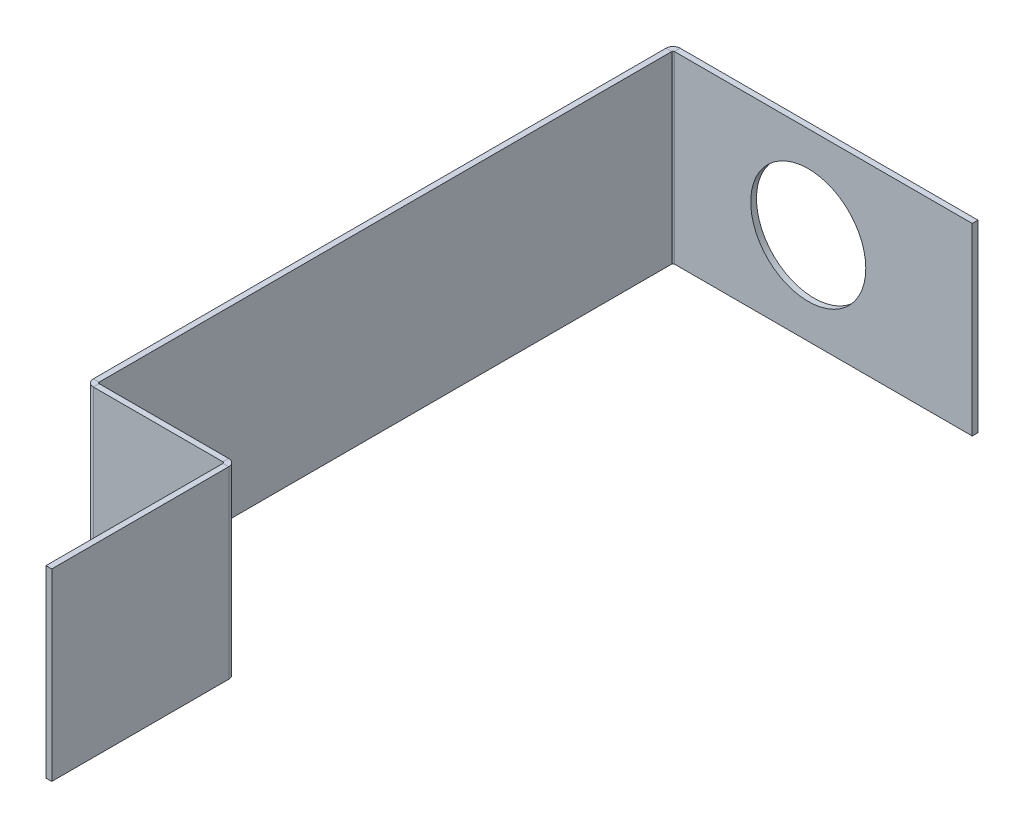
ISO-10303-21;
HEADER;
FILE_DESCRIPTION(('STEP AP214'),'2;1');
FILE_NAME('part.step','',(''),(''),'','','');
FILE_SCHEMA(('AUTOMOTIVE_DESIGN { 1 0 10303 214 1 1 1 1 }'));
ENDSEC;
DATA;
#1=APPLICATION_CONTEXT('core data for automotive mechanical design processes');
#2=APPLICATION_PROTOCOL_DEFINITION('international standard','automotive_design',2000,#1);
#3=PRODUCT_CONTEXT('',#1,'mechanical');
#4=PRODUCT('Part','Part','',(#3));
#5=PRODUCT_RELATED_PRODUCT_CATEGORY('part','',(#4));
#6=PRODUCT_DEFINITION_FORMATION('','',#4);
#7=PRODUCT_DEFINITION_CONTEXT('part definition',#1,'design');
#8=PRODUCT_DEFINITION('design','',#6,#7);
#9=PRODUCT_DEFINITION_SHAPE('','',#8);
#10=(LENGTH_UNIT() NAMED_UNIT(*) SI_UNIT(.MILLI.,.METRE.));
#11=(NAMED_UNIT(*) PLANE_ANGLE_UNIT() SI_UNIT($,.RADIAN.));
#12=(NAMED_UNIT(*) SI_UNIT($,.STERADIAN.) SOLID_ANGLE_UNIT());
#13=UNCERTAINTY_MEASURE_WITH_UNIT(LENGTH_MEASURE(1.E-05),#10,'distance_accuracy_value','');
#14=(GEOMETRIC_REPRESENTATION_CONTEXT(3) GLOBAL_UNCERTAINTY_ASSIGNED_CONTEXT((#13)) GLOBAL_UNIT_ASSIGNED_CONTEXT((#10,
#11,#12)) REPRESENTATION_CONTEXT('',''));
#15=CARTESIAN_POINT('',(0.,0.,0.));
#16=DIRECTION('',(0.,0.,1.));
#17=DIRECTION('',(1.,0.,0.));
#18=AXIS2_PLACEMENT_3D('',#15,#16,#17);
#19=CARTESIAN_POINT('',(0.,101.6,-189.7634));
#20=DIRECTION('',(0.,1.,0.));
#21=DIRECTION('',(0.,0.,1.));
#22=AXIS2_PLACEMENT_3D('',#19,#20,#21);
#23=PLANE('',#22);
#24=DIRECTION('',(-1.,0.,0.));
#25=VECTOR('',#24,1.);
#26=CARTESIAN_POINT('',(0.,101.6,-189.7634));
#27=LINE('',#26,#25);
#28=CARTESIAN_POINT('',(0.,101.6,-189.7634));
#29=VERTEX_POINT('',#28);
#30=CARTESIAN_POINT('',(-3.175,101.6,-189.7634));
#31=VERTEX_POINT('',#30);
#32=EDGE_CURVE('E11',#29,#31,#27,.T.);
#33=ORIENTED_EDGE('',*,*,#32,.F.);
#34=CARTESIAN_POINT('',(0.7366,101.6,-189.7634));
#35=DIRECTION('',(0.,-1.,0.));
#36=DIRECTION('',(0.,0.,-1.));
#37=AXIS2_PLACEMENT_3D('',#34,#35,#36);
#38=CIRCLE('',#37,0.7366);
#39=CARTESIAN_POINT('',(0.7366,101.6,-190.5));
#40=VERTEX_POINT('',#39);
#41=EDGE_CURVE('E310',#40,#29,#38,.F.);
#42=ORIENTED_EDGE('',*,*,#41,.F.);
#43=DIRECTION('',(0.,0.,1.));
#44=VECTOR('',#43,1.);
#45=CARTESIAN_POINT('',(0.7366,101.6,-193.675));
#46=LINE('',#45,#44);
#47=CARTESIAN_POINT('',(0.7366,101.6,-193.675));
#48=VERTEX_POINT('',#47);
#49=EDGE_CURVE('E44',#48,#40,#46,.T.);
#50=ORIENTED_EDGE('',*,*,#49,.F.);
#51=CARTESIAN_POINT('',(0.7366,101.6,-189.7634));
#52=DIRECTION('',(0.,1.,0.));
#53=DIRECTION('',(1.,0.,0.));
#54=AXIS2_PLACEMENT_3D('',#51,#52,#53);
#55=CIRCLE('',#54,3.9116);
#56=EDGE_CURVE('E323',#48,#31,#55,.T.);
#57=ORIENTED_EDGE('',*,*,#56,.T.);
#58=EDGE_LOOP('',(#33,#42,#50,#57));
#59=FACE_BOUND('',#58,.T.);
#60=ADVANCED_FACE('F36',(#59),#23,.T.);
#61=CARTESIAN_POINT('',(0.7366,101.6,-193.675));
#62=DIRECTION('',(0.,1.,0.));
#63=DIRECTION('',(0.,0.,1.));
#64=AXIS2_PLACEMENT_3D('',#61,#62,#63);
#65=PLANE('',#64);
#66=DIRECTION('',(0.,0.,1.));
#67=VECTOR('',#66,1.);
#68=CARTESIAN_POINT('',(0.,101.6,0.));
#69=LINE('',#68,#67);
#70=CARTESIAN_POINT('',(0.,101.6,126.2634));
#71=VERTEX_POINT('',#70);
#72=EDGE_CURVE('E314',#29,#71,#69,.T.);
#73=ORIENTED_EDGE('',*,*,#72,.F.);
#74=ORIENTED_EDGE('',*,*,#32,.T.);
#75=DIRECTION('',(0.,0.,-1.));
#76=VECTOR('',#75,1.);
#77=CARTESIAN_POINT('',(-3.175,101.6,0.));
#78=LINE('',#77,#76);
#79=CARTESIAN_POINT('',(-3.17499999999998,101.6,126.2634));
#80=VERTEX_POINT('',#79);
#81=EDGE_CURVE('E179',#31,#80,#78,.F.);
#82=ORIENTED_EDGE('',*,*,#81,.T.);
#83=DIRECTION('',(1.,0.,0.));
#84=VECTOR('',#83,1.);
#85=CARTESIAN_POINT('',(-3.17499999999998,101.6,126.2634));
#86=LINE('',#85,#84);
#87=EDGE_CURVE('E170',#80,#71,#86,.T.);
#88=ORIENTED_EDGE('',*,*,#87,.T.);
#89=EDGE_LOOP('',(#73,#74,#82,#88));
#90=FACE_BOUND('',#89,.T.);
#91=ADVANCED_FACE('F327',(#90),#65,.T.);
#92=CARTESIAN_POINT('',(0.7366,0.,-190.5));
#93=DIRECTION('',(0.,-1.,0.));
#94=DIRECTION('',(0.,0.,-1.));
#95=AXIS2_PLACEMENT_3D('',#92,#93,#94);
#96=PLANE('',#95);
#97=DIRECTION('',(0.,0.,-1.));
#98=VECTOR('',#97,1.);
#99=CARTESIAN_POINT('',(0.7366,0.,-190.5));
#100=LINE('',#99,#98);
#101=CARTESIAN_POINT('',(0.7366,0.,-190.5));
#102=VERTEX_POINT('',#101);
#103=CARTESIAN_POINT('',(0.7366,0.,-193.675));
#104=VERTEX_POINT('',#103);
#105=EDGE_CURVE('E290',#102,#104,#100,.T.);
#106=ORIENTED_EDGE('',*,*,#105,.F.);
#107=CARTESIAN_POINT('',(0.7366,0.,-189.7634));
#108=DIRECTION('',(0.,-1.,0.));
#109=DIRECTION('',(0.,0.,-1.));
#110=AXIS2_PLACEMENT_3D('',#107,#108,#109);
#111=CIRCLE('',#110,0.7366);
#112=CARTESIAN_POINT('',(0.,0.,-189.7634));
#113=VERTEX_POINT('',#112);
#114=EDGE_CURVE('E220',#102,#113,#111,.F.);
#115=ORIENTED_EDGE('',*,*,#114,.T.);
#116=DIRECTION('',(1.,0.,0.));
#117=VECTOR('',#116,1.);
#118=CARTESIAN_POINT('',(-3.175,0.,-189.7634));
#119=LINE('',#118,#117);
#120=CARTESIAN_POINT('',(-3.175,0.,-189.7634));
#121=VERTEX_POINT('',#120);
#122=EDGE_CURVE('E169',#121,#113,#119,.T.);
#123=ORIENTED_EDGE('',*,*,#122,.F.);
#124=CARTESIAN_POINT('',(0.7366,0.,-189.7634));
#125=DIRECTION('',(0.,1.,0.));
#126=DIRECTION('',(1.,0.,0.));
#127=AXIS2_PLACEMENT_3D('',#124,#125,#126);
#128=CIRCLE('',#127,3.9116);
#129=EDGE_CURVE('E232',#104,#121,#128,.T.);
#130=ORIENTED_EDGE('',*,*,#129,.F.);
#131=EDGE_LOOP('',(#106,#115,#123,#130));
#132=FACE_BOUND('',#131,.T.);
#133=ADVANCED_FACE('F381',(#132),#96,.T.);
#134=CARTESIAN_POINT('',(-3.175,0.,-189.7634));
#135=DIRECTION('',(0.,-1.,0.));
#136=DIRECTION('',(0.,0.,-1.));
#137=AXIS2_PLACEMENT_3D('',#134,#135,#136);
#138=PLANE('',#137);
#139=DIRECTION('',(-1.,0.,0.));
#140=VECTOR('',#139,1.);
#141=CARTESIAN_POINT('',(0.,0.,-190.5));
#142=LINE('',#141,#140);
#143=CARTESIAN_POINT('',(165.1,0.,-190.5));
#144=VERTEX_POINT('',#143);
#145=EDGE_CURVE('E223',#144,#102,#142,.T.);
#146=ORIENTED_EDGE('',*,*,#145,.T.);
#147=ORIENTED_EDGE('',*,*,#105,.T.);
#148=DIRECTION('',(1.,0.,0.));
#149=VECTOR('',#148,1.);
#150=CARTESIAN_POINT('',(0.,0.,-193.675));
#151=LINE('',#150,#149);
#152=CARTESIAN_POINT('',(165.1,0.,-193.675));
#153=VERTEX_POINT('',#152);
#154=EDGE_CURVE('E229',#153,#104,#151,.F.);
#155=ORIENTED_EDGE('',*,*,#154,.F.);
#156=DIRECTION('',(0.,0.,1.));
#157=VECTOR('',#156,1.);
#158=CARTESIAN_POINT('',(165.1,0.,-193.675));
#159=LINE('',#158,#157);
#160=EDGE_CURVE('E226',#153,#144,#159,.T.);
#161=ORIENTED_EDGE('',*,*,#160,.T.);
#162=EDGE_LOOP('',(#146,#147,#155,#161));
#163=FACE_BOUND('',#162,.T.);
#164=ADVANCED_FACE('F385',(#163),#138,.T.);
#165=CARTESIAN_POINT('',(0.736600000000015,101.6,127.));
#166=DIRECTION('',(0.,1.,0.));
#167=DIRECTION('',(0.,0.,1.));
#168=AXIS2_PLACEMENT_3D('',#165,#166,#167);
#169=PLANE('',#168);
#170=DIRECTION('',(0.,0.,1.));
#171=VECTOR('',#170,1.);
#172=CARTESIAN_POINT('',(0.736600000000015,101.6,127.));
#173=LINE('',#172,#171);
#174=CARTESIAN_POINT('',(0.736600000000015,101.6,127.));
#175=VERTEX_POINT('',#174);
#176=CARTESIAN_POINT('',(0.736600000000015,101.6,130.175));
#177=VERTEX_POINT('',#176);
#178=EDGE_CURVE('E157',#175,#177,#173,.T.);
#179=ORIENTED_EDGE('',*,*,#178,.F.);
#180=CARTESIAN_POINT('',(0.736600000000015,101.6,126.2634));
#181=DIRECTION('',(0.,-1.,0.));
#182=DIRECTION('',(0.,0.,-1.));
#183=AXIS2_PLACEMENT_3D('',#180,#181,#182);
#184=CIRCLE('',#183,0.7366);
#185=EDGE_CURVE('E339',#71,#175,#184,.F.);
#186=ORIENTED_EDGE('',*,*,#185,.F.);
#187=ORIENTED_EDGE('',*,*,#87,.F.);
#188=CARTESIAN_POINT('',(0.736600000000015,101.6,126.2634));
#189=DIRECTION('',(0.,1.,0.));
#190=DIRECTION('',(1.,0.,0.));
#191=AXIS2_PLACEMENT_3D('',#188,#189,#190);
#192=CIRCLE('',#191,3.9116);
#193=EDGE_CURVE('E173',#80,#177,#192,.T.);
#194=ORIENTED_EDGE('',*,*,#193,.T.);
#195=EDGE_LOOP('',(#179,#186,#187,#194));
#196=FACE_BOUND('',#195,.T.);
#197=ADVANCED_FACE('F175',(#196),#169,.T.);
#198=CARTESIAN_POINT('',(-3.17499999999998,101.6,126.2634));
#199=DIRECTION('',(0.,1.,0.));
#200=DIRECTION('',(0.,0.,1.));
#201=AXIS2_PLACEMENT_3D('',#198,#199,#200);
#202=PLANE('',#201);
#203=DIRECTION('',(1.,0.,0.));
#204=VECTOR('',#203,1.);
#205=CARTESIAN_POINT('',(0.,101.6,127.));
#206=LINE('',#205,#204);
#207=CARTESIAN_POINT('',(72.2884,101.6,127.));
#208=VERTEX_POINT('',#207);
#209=EDGE_CURVE('E164',#175,#208,#206,.T.);
#210=ORIENTED_EDGE('',*,*,#209,.F.);
#211=ORIENTED_EDGE('',*,*,#178,.T.);
#212=DIRECTION('',(1.,0.,0.));
#213=VECTOR('',#212,1.);
#214=CARTESIAN_POINT('',(0.,101.6,130.175));
#215=LINE('',#214,#213);
#216=CARTESIAN_POINT('',(72.2884,101.6,130.175));
#217=VERTEX_POINT('',#216);
#218=EDGE_CURVE('E161',#177,#217,#215,.T.);
#219=ORIENTED_EDGE('',*,*,#218,.T.);
#220=DIRECTION('',(0.,0.,-1.));
#221=VECTOR('',#220,1.);
#222=CARTESIAN_POINT('',(72.2884,101.6,130.175));
#223=LINE('',#222,#221);
#224=EDGE_CURVE('E281',#217,#208,#223,.T.);
#225=ORIENTED_EDGE('',*,*,#224,.T.);
#226=EDGE_LOOP('',(#210,#211,#219,#225));
#227=FACE_BOUND('',#226,.T.);
#228=ADVANCED_FACE('F159',(#227),#202,.T.);
#229=CARTESIAN_POINT('',(0.,0.,126.2634));
#230=DIRECTION('',(0.,-1.,0.));
#231=DIRECTION('',(0.,0.,-1.));
#232=AXIS2_PLACEMENT_3D('',#229,#230,#231);
#233=PLANE('',#232);
#234=DIRECTION('',(-1.,0.,0.));
#235=VECTOR('',#234,1.);
#236=CARTESIAN_POINT('',(0.,0.,126.2634));
#237=LINE('',#236,#235);
#238=CARTESIAN_POINT('',(0.,0.,126.2634));
#239=VERTEX_POINT('',#238);
#240=CARTESIAN_POINT('',(-3.17499999999998,0.,126.2634));
#241=VERTEX_POINT('',#240);
#242=EDGE_CURVE('E286',#239,#241,#237,.T.);
#243=ORIENTED_EDGE('',*,*,#242,.F.);
#244=CARTESIAN_POINT('',(0.736600000000015,0.,126.2634));
#245=DIRECTION('',(0.,-1.,0.));
#246=DIRECTION('',(0.,0.,-1.));
#247=AXIS2_PLACEMENT_3D('',#244,#245,#246);
#248=CIRCLE('',#247,0.7366);
#249=CARTESIAN_POINT('',(0.736600000000015,0.,127.));
#250=VERTEX_POINT('',#249);
#251=EDGE_CURVE('E214',#239,#250,#248,.F.);
#252=ORIENTED_EDGE('',*,*,#251,.T.);
#253=DIRECTION('',(0.,0.,-1.));
#254=VECTOR('',#253,1.);
#255=CARTESIAN_POINT('',(0.736600000000015,0.,130.175));
#256=LINE('',#255,#254);
#257=CARTESIAN_POINT('',(0.736600000000015,0.,130.175));
#258=VERTEX_POINT('',#257);
#259=EDGE_CURVE('E284',#258,#250,#256,.T.);
#260=ORIENTED_EDGE('',*,*,#259,.F.);
#261=CARTESIAN_POINT('',(0.736600000000015,0.,126.2634));
#262=DIRECTION('',(0.,1.,0.));
#263=DIRECTION('',(1.,0.,0.));
#264=AXIS2_PLACEMENT_3D('',#261,#262,#263);
#265=CIRCLE('',#264,3.9116);
#266=EDGE_CURVE('E186',#241,#258,#265,.T.);
#267=ORIENTED_EDGE('',*,*,#266,.F.);
#268=EDGE_LOOP('',(#243,#252,#260,#267));
#269=FACE_BOUND('',#268,.T.);
#270=ADVANCED_FACE('F333',(#269),#233,.T.);
#271=CARTESIAN_POINT('',(0.736600000000015,0.,130.175));
#272=DIRECTION('',(0.,-1.,0.));
#273=DIRECTION('',(0.,0.,-1.));
#274=AXIS2_PLACEMENT_3D('',#271,#272,#273);
#275=PLANE('',#274);
#276=DIRECTION('',(0.,0.,1.));
#277=VECTOR('',#276,1.);
#278=CARTESIAN_POINT('',(0.,0.,0.));
#279=LINE('',#278,#277);
#280=EDGE_CURVE('E217',#113,#239,#279,.T.);
#281=ORIENTED_EDGE('',*,*,#280,.T.);
#282=ORIENTED_EDGE('',*,*,#242,.T.);
#283=DIRECTION('',(0.,0.,1.));
#284=VECTOR('',#283,1.);
#285=CARTESIAN_POINT('',(-3.175,0.,0.));
#286=LINE('',#285,#284);
#287=EDGE_CURVE('E235',#121,#241,#286,.T.);
#288=ORIENTED_EDGE('',*,*,#287,.F.);
#289=ORIENTED_EDGE('',*,*,#122,.T.);
#290=EDGE_LOOP('',(#281,#282,#288,#289));
#291=FACE_BOUND('',#290,.T.);
#292=ADVANCED_FACE('F420',(#291),#275,.T.);
#293=CARTESIAN_POINT('',(76.2,101.6,130.9116));
#294=DIRECTION('',(0.,1.,0.));
#295=DIRECTION('',(0.,0.,1.));
#296=AXIS2_PLACEMENT_3D('',#293,#294,#295);
#297=PLANE('',#296);
#298=DIRECTION('',(-1.,0.,0.));
#299=VECTOR('',#298,1.);
#300=CARTESIAN_POINT('',(76.2,101.6,130.9116));
#301=LINE('',#300,#299);
#302=CARTESIAN_POINT('',(76.2,101.6,130.9116));
#303=VERTEX_POINT('',#302);
#304=CARTESIAN_POINT('',(73.025,101.6,130.9116));
#305=VERTEX_POINT('',#304);
#306=EDGE_CURVE('E52',#303,#305,#301,.T.);
#307=ORIENTED_EDGE('',*,*,#306,.F.);
#308=CARTESIAN_POINT('',(72.2884,101.6,130.9116));
#309=DIRECTION('',(0.,1.,0.));
#310=DIRECTION('',(0.,0.,1.));
#311=AXIS2_PLACEMENT_3D('',#308,#309,#310);
#312=CIRCLE('',#311,3.9116);
#313=EDGE_CURVE('E367',#208,#303,#312,.F.);
#314=ORIENTED_EDGE('',*,*,#313,.F.);
#315=ORIENTED_EDGE('',*,*,#224,.F.);
#316=CARTESIAN_POINT('',(72.2884,101.6,130.9116));
#317=DIRECTION('',(0.,1.,0.));
#318=DIRECTION('',(1.,0.,0.));
#319=AXIS2_PLACEMENT_3D('',#316,#317,#318);
#320=CIRCLE('',#319,0.7366);
#321=EDGE_CURVE('E194',#217,#305,#320,.F.);
#322=ORIENTED_EDGE('',*,*,#321,.T.);
#323=EDGE_LOOP('',(#307,#314,#315,#322));
#324=FACE_BOUND('',#323,.T.);
#325=ADVANCED_FACE('F423',(#324),#297,.T.);
#326=CARTESIAN_POINT('',(72.2884,101.6,130.175));
#327=DIRECTION('',(0.,1.,0.));
#328=DIRECTION('',(0.,0.,1.));
#329=AXIS2_PLACEMENT_3D('',#326,#327,#328);
#330=PLANE('',#329);
#331=DIRECTION('',(0.,0.,1.));
#332=VECTOR('',#331,1.);
#333=CARTESIAN_POINT('',(76.2,101.6,127.));
#334=LINE('',#333,#332);
#335=CARTESIAN_POINT('',(76.2,101.6,228.6));
#336=VERTEX_POINT('',#335);
#337=EDGE_CURVE('E365',#303,#336,#334,.T.);
#338=ORIENTED_EDGE('',*,*,#337,.F.);
#339=ORIENTED_EDGE('',*,*,#306,.T.);
#340=DIRECTION('',(0.,0.,-1.));
#341=VECTOR('',#340,1.);
#342=CARTESIAN_POINT('',(73.025,101.6,127.));
#343=LINE('',#342,#341);
#344=CARTESIAN_POINT('',(73.025,101.6,228.6));
#345=VERTEX_POINT('',#344);
#346=EDGE_CURVE('E118',#305,#345,#343,.F.);
#347=ORIENTED_EDGE('',*,*,#346,.T.);
#348=DIRECTION('',(-1.,0.,0.));
#349=VECTOR('',#348,1.);
#350=CARTESIAN_POINT('',(76.2,101.6,228.6));
#351=LINE('',#350,#349);
#352=EDGE_CURVE('E363',#336,#345,#351,.T.);
#353=ORIENTED_EDGE('',*,*,#352,.F.);
#354=EDGE_LOOP('',(#338,#339,#347,#353));
#355=FACE_BOUND('',#354,.T.);
#356=ADVANCED_FACE('F426',(#355),#330,.T.);
#357=CARTESIAN_POINT('',(72.2884,0.,127.));
#358=DIRECTION('',(0.,-1.,0.));
#359=DIRECTION('',(0.,0.,-1.));
#360=AXIS2_PLACEMENT_3D('',#357,#358,#359);
#361=PLANE('',#360);
#362=DIRECTION('',(0.,0.,1.));
#363=VECTOR('',#362,1.);
#364=CARTESIAN_POINT('',(72.2884,0.,127.));
#365=LINE('',#364,#363);
#366=CARTESIAN_POINT('',(72.2884,0.,127.));
#367=VERTEX_POINT('',#366);
#368=CARTESIAN_POINT('',(72.2884,0.,130.175));
#369=VERTEX_POINT('',#368);
#370=EDGE_CURVE('E105',#367,#369,#365,.T.);
#371=ORIENTED_EDGE('',*,*,#370,.F.);
#372=CARTESIAN_POINT('',(72.2884,0.,130.9116));
#373=DIRECTION('',(0.,1.,0.));
#374=DIRECTION('',(0.,0.,1.));
#375=AXIS2_PLACEMENT_3D('',#372,#373,#374);
#376=CIRCLE('',#375,3.9116);
#377=CARTESIAN_POINT('',(76.2,0.,130.9116));
#378=VERTEX_POINT('',#377);
#379=EDGE_CURVE('E210',#367,#378,#376,.F.);
#380=ORIENTED_EDGE('',*,*,#379,.T.);
#381=DIRECTION('',(1.,0.,0.));
#382=VECTOR('',#381,1.);
#383=CARTESIAN_POINT('',(73.025,0.,130.9116));
#384=LINE('',#383,#382);
#385=CARTESIAN_POINT('',(73.025,0.,130.9116));
#386=VERTEX_POINT('',#385);
#387=EDGE_CURVE('E112',#386,#378,#384,.T.);
#388=ORIENTED_EDGE('',*,*,#387,.F.);
#389=CARTESIAN_POINT('',(72.2884,0.,130.9116));
#390=DIRECTION('',(0.,1.,0.));
#391=DIRECTION('',(1.,0.,0.));
#392=AXIS2_PLACEMENT_3D('',#389,#390,#391);
#393=CIRCLE('',#392,0.7366);
#394=EDGE_CURVE('E241',#369,#386,#393,.F.);
#395=ORIENTED_EDGE('',*,*,#394,.F.);
#396=EDGE_LOOP('',(#371,#380,#388,#395));
#397=FACE_BOUND('',#396,.T.);
#398=ADVANCED_FACE('F350',(#397),#361,.T.);
#399=CARTESIAN_POINT('',(73.025,0.,130.9116));
#400=DIRECTION('',(0.,-1.,0.));
#401=DIRECTION('',(0.,0.,-1.));
#402=AXIS2_PLACEMENT_3D('',#399,#400,#401);
#403=PLANE('',#402);
#404=DIRECTION('',(1.,0.,0.));
#405=VECTOR('',#404,1.);
#406=CARTESIAN_POINT('',(0.,0.,127.));
#407=LINE('',#406,#405);
#408=EDGE_CURVE('E212',#250,#367,#407,.T.);
#409=ORIENTED_EDGE('',*,*,#408,.T.);
#410=ORIENTED_EDGE('',*,*,#370,.T.);
#411=DIRECTION('',(1.,0.,0.));
#412=VECTOR('',#411,1.);
#413=CARTESIAN_POINT('',(0.,0.,130.175));
#414=LINE('',#413,#412);
#415=EDGE_CURVE('E239',#258,#369,#414,.T.);
#416=ORIENTED_EDGE('',*,*,#415,.F.);
#417=ORIENTED_EDGE('',*,*,#259,.T.);
#418=EDGE_LOOP('',(#409,#410,#416,#417));
#419=FACE_BOUND('',#418,.T.);
#420=ADVANCED_FACE('F335',(#419),#403,.T.);
#421=CARTESIAN_POINT('',(73.025,101.6,127.));
#422=DIRECTION('',(1.,0.,0.));
#423=DIRECTION('',(0.,0.,-1.));
#424=AXIS2_PLACEMENT_3D('',#421,#422,#423);
#425=PLANE('',#424);
#426=DIRECTION('',(0.,0.,-1.));
#427=VECTOR('',#426,1.);
#428=CARTESIAN_POINT('',(73.025,0.,127.));
#429=LINE('',#428,#427);
#430=CARTESIAN_POINT('',(73.025,0.,228.6));
#431=VERTEX_POINT('',#430);
#432=EDGE_CURVE('E200',#386,#431,#429,.F.);
#433=ORIENTED_EDGE('',*,*,#432,.T.);
#434=DIRECTION('',(0.,-1.,0.));
#435=VECTOR('',#434,1.);
#436=CARTESIAN_POINT('',(73.025,101.6,228.6));
#437=LINE('',#436,#435);
#438=EDGE_CURVE('E277',#345,#431,#437,.T.);
#439=ORIENTED_EDGE('',*,*,#438,.F.);
#440=ORIENTED_EDGE('',*,*,#346,.F.);
#441=DIRECTION('',(0.,-1.,0.));
#442=VECTOR('',#441,1.);
#443=CARTESIAN_POINT('',(73.025,101.6,130.9116));
#444=LINE('',#443,#442);
#445=EDGE_CURVE('E196',#305,#386,#444,.T.);
#446=ORIENTED_EDGE('',*,*,#445,.T.);
#447=EDGE_LOOP('',(#433,#439,#440,#446));
#448=FACE_BOUND('',#447,.T.);
#449=ADVANCED_FACE('F356',(#448),#425,.F.);
#450=CARTESIAN_POINT('',(76.2,101.6,228.6));
#451=DIRECTION('',(0.,0.,1.));
#452=DIRECTION('',(1.,0.,0.));
#453=AXIS2_PLACEMENT_3D('',#450,#451,#452);
#454=PLANE('',#453);
#455=DIRECTION('',(-1.,0.,0.));
#456=VECTOR('',#455,1.);
#457=CARTESIAN_POINT('',(76.2,0.,228.6));
#458=LINE('',#457,#456);
#459=CARTESIAN_POINT('',(76.2,0.,228.6));
#460=VERTEX_POINT('',#459);
#461=EDGE_CURVE('E203',#460,#431,#458,.T.);
#462=ORIENTED_EDGE('',*,*,#461,.F.);
#463=DIRECTION('',(0.,-1.,0.));
#464=VECTOR('',#463,1.);
#465=CARTESIAN_POINT('',(76.2,101.6,228.6));
#466=LINE('',#465,#464);
#467=EDGE_CURVE('E275',#336,#460,#466,.T.);
#468=ORIENTED_EDGE('',*,*,#467,.F.);
#469=ORIENTED_EDGE('',*,*,#352,.T.);
#470=ORIENTED_EDGE('',*,*,#438,.T.);
#471=EDGE_LOOP('',(#462,#468,#469,#470));
#472=FACE_BOUND('',#471,.T.);
#473=ADVANCED_FACE('F361',(#472),#454,.T.);
#474=CARTESIAN_POINT('',(76.2,101.6,127.));
#475=DIRECTION('',(1.,0.,0.));
#476=DIRECTION('',(0.,0.,-1.));
#477=AXIS2_PLACEMENT_3D('',#474,#475,#476);
#478=PLANE('',#477);
#479=DIRECTION('',(0.,0.,1.));
#480=VECTOR('',#479,1.);
#481=CARTESIAN_POINT('',(76.2,0.,127.));
#482=LINE('',#481,#480);
#483=EDGE_CURVE('E207',#378,#460,#482,.T.);
#484=ORIENTED_EDGE('',*,*,#483,.F.);
#485=DIRECTION('',(0.,-1.,0.));
#486=VECTOR('',#485,1.);
#487=CARTESIAN_POINT('',(76.2,101.6,130.9116));
#488=LINE('',#487,#486);
#489=EDGE_CURVE('E272',#303,#378,#488,.T.);
#490=ORIENTED_EDGE('',*,*,#489,.F.);
#491=ORIENTED_EDGE('',*,*,#337,.T.);
#492=ORIENTED_EDGE('',*,*,#467,.T.);
#493=EDGE_LOOP('',(#484,#490,#491,#492));
#494=FACE_BOUND('',#493,.T.);
#495=ADVANCED_FACE('F438',(#494),#478,.T.);
#496=CARTESIAN_POINT('',(72.2884,101.6,130.9116));
#497=DIRECTION('',(0.,-1.,0.));
#498=DIRECTION('',(0.,0.,-1.));
#499=AXIS2_PLACEMENT_3D('',#496,#497,#498);
#500=CYLINDRICAL_SURFACE('',#499,3.9116);
#501=ORIENTED_EDGE('',*,*,#379,.F.);
#502=DIRECTION('',(0.,-1.,0.));
#503=VECTOR('',#502,1.);
#504=CARTESIAN_POINT('',(72.2884,101.6,127.));
#505=LINE('',#504,#503);
#506=EDGE_CURVE('E269',#208,#367,#505,.T.);
#507=ORIENTED_EDGE('',*,*,#506,.F.);
#508=ORIENTED_EDGE('',*,*,#313,.T.);
#509=ORIENTED_EDGE('',*,*,#489,.T.);
#510=EDGE_LOOP('',(#501,#507,#508,#509));
#511=FACE_BOUND('',#510,.T.);
#512=ADVANCED_FACE('F347',(#511),#500,.T.);
#513=CARTESIAN_POINT('',(0.,101.6,127.));
#514=DIRECTION('',(0.,0.,-1.));
#515=DIRECTION('',(-1.,0.,0.));
#516=AXIS2_PLACEMENT_3D('',#513,#514,#515);
#517=PLANE('',#516);
#518=ORIENTED_EDGE('',*,*,#408,.F.);
#519=DIRECTION('',(0.,-1.,0.));
#520=VECTOR('',#519,1.);
#521=CARTESIAN_POINT('',(0.736600000000015,101.6,127.));
#522=LINE('',#521,#520);
#523=EDGE_CURVE('E266',#175,#250,#522,.T.);
#524=ORIENTED_EDGE('',*,*,#523,.F.);
#525=ORIENTED_EDGE('',*,*,#209,.T.);
#526=ORIENTED_EDGE('',*,*,#506,.T.);
#527=EDGE_LOOP('',(#518,#524,#525,#526));
#528=FACE_BOUND('',#527,.T.);
#529=ADVANCED_FACE('F341',(#528),#517,.T.);
#530=CARTESIAN_POINT('',(0.736600000000015,101.6,126.2634));
#531=DIRECTION('',(0.,-1.,0.));
#532=DIRECTION('',(0.,0.,-1.));
#533=AXIS2_PLACEMENT_3D('',#530,#531,#532);
#534=CYLINDRICAL_SURFACE('',#533,0.7366);
#535=ORIENTED_EDGE('',*,*,#251,.F.);
#536=DIRECTION('',(0.,-1.,0.));
#537=VECTOR('',#536,1.);
#538=CARTESIAN_POINT('',(0.,101.6,126.2634));
#539=LINE('',#538,#537);
#540=EDGE_CURVE('E263',#71,#239,#539,.T.);
#541=ORIENTED_EDGE('',*,*,#540,.F.);
#542=ORIENTED_EDGE('',*,*,#185,.T.);
#543=ORIENTED_EDGE('',*,*,#523,.T.);
#544=EDGE_LOOP('',(#535,#541,#542,#543));
#545=FACE_BOUND('',#544,.T.);
#546=ADVANCED_FACE('F338',(#545),#534,.F.);
#547=CARTESIAN_POINT('',(0.,101.6,0.));
#548=DIRECTION('',(1.,0.,0.));
#549=DIRECTION('',(0.,0.,-1.));
#550=AXIS2_PLACEMENT_3D('',#547,#548,#549);
#551=PLANE('',#550);
#552=ORIENTED_EDGE('',*,*,#280,.F.);
#553=DIRECTION('',(0.,-1.,0.));
#554=VECTOR('',#553,1.);
#555=CARTESIAN_POINT('',(0.,101.6,-189.7634));
#556=LINE('',#555,#554);
#557=EDGE_CURVE('E260',#29,#113,#556,.T.);
#558=ORIENTED_EDGE('',*,*,#557,.F.);
#559=ORIENTED_EDGE('',*,*,#72,.T.);
#560=ORIENTED_EDGE('',*,*,#540,.T.);
#561=EDGE_LOOP('',(#552,#558,#559,#560));
#562=FACE_BOUND('',#561,.T.);
#563=ADVANCED_FACE('F378',(#562),#551,.T.);
#564=CARTESIAN_POINT('',(0.7366,101.6,-189.7634));
#565=DIRECTION('',(0.,-1.,0.));
#566=DIRECTION('',(0.,0.,-1.));
#567=AXIS2_PLACEMENT_3D('',#564,#565,#566);
#568=CYLINDRICAL_SURFACE('',#567,0.7366);
#569=ORIENTED_EDGE('',*,*,#114,.F.);
#570=DIRECTION('',(0.,-1.,0.));
#571=VECTOR('',#570,1.);
#572=CARTESIAN_POINT('',(0.7366,101.6,-190.5));
#573=LINE('',#572,#571);
#574=EDGE_CURVE('E257',#40,#102,#573,.T.);
#575=ORIENTED_EDGE('',*,*,#574,.F.);
#576=ORIENTED_EDGE('',*,*,#41,.T.);
#577=ORIENTED_EDGE('',*,*,#557,.T.);
#578=EDGE_LOOP('',(#569,#575,#576,#577));
#579=FACE_BOUND('',#578,.T.);
#580=ADVANCED_FACE('F309',(#579),#568,.F.);
#581=CARTESIAN_POINT('',(0.,101.6,-190.5));
#582=DIRECTION('',(0.,0.,1.));
#583=DIRECTION('',(1.,0.,0.));
#584=AXIS2_PLACEMENT_3D('',#581,#582,#583);
#585=PLANE('',#584);
#586=CARTESIAN_POINT('',(74.5998,50.8,-190.5));
#587=DIRECTION('',(0.,0.,1.));
#588=DIRECTION('',(1.,0.,0.));
#589=AXIS2_PLACEMENT_3D('',#586,#587,#588);
#590=CIRCLE('',#589,31.75);
#591=CARTESIAN_POINT('',(106.3498,50.8,-190.5));
#592=VERTEX_POINT('',#591);
#593=EDGE_CURVE('E724',#592,#592,#590,.T.);
#594=ORIENTED_EDGE('',*,*,#593,.F.);
#595=EDGE_LOOP('',(#594));
#596=FACE_BOUND('',#595,.T.);
#597=ORIENTED_EDGE('',*,*,#145,.F.);
#598=DIRECTION('',(0.,-1.,0.));
#599=VECTOR('',#598,1.);
#600=CARTESIAN_POINT('',(165.1,101.6,-190.5));
#601=LINE('',#600,#599);
#602=CARTESIAN_POINT('',(165.1,101.6,-190.5));
#603=VERTEX_POINT('',#602);
#604=EDGE_CURVE('E255',#603,#144,#601,.T.);
#605=ORIENTED_EDGE('',*,*,#604,.F.);
#606=DIRECTION('',(-1.,0.,0.));
#607=VECTOR('',#606,1.);
#608=CARTESIAN_POINT('',(0.,101.6,-190.5));
#609=LINE('',#608,#607);
#610=EDGE_CURVE('E298',#603,#40,#609,.T.);
#611=ORIENTED_EDGE('',*,*,#610,.T.);
#612=ORIENTED_EDGE('',*,*,#574,.T.);
#613=EDGE_LOOP('',(#597,#605,#611,#612));
#614=FACE_BOUND('',#613,.T.);
#615=ADVANCED_FACE('F316',(#596,#614),#585,.T.);
#616=CARTESIAN_POINT('',(165.1,101.6,-193.675));
#617=DIRECTION('',(1.,0.,0.));
#618=DIRECTION('',(0.,0.,-1.));
#619=AXIS2_PLACEMENT_3D('',#616,#617,#618);
#620=PLANE('',#619);
#621=ORIENTED_EDGE('',*,*,#160,.F.);
#622=DIRECTION('',(0.,-1.,0.));
#623=VECTOR('',#622,1.);
#624=CARTESIAN_POINT('',(165.1,101.6,-193.675));
#625=LINE('',#624,#623);
#626=CARTESIAN_POINT('',(165.1,101.6,-193.675));
#627=VERTEX_POINT('',#626);
#628=EDGE_CURVE('E253',#627,#153,#625,.T.);
#629=ORIENTED_EDGE('',*,*,#628,.F.);
#630=DIRECTION('',(0.,0.,1.));
#631=VECTOR('',#630,1.);
#632=CARTESIAN_POINT('',(165.1,101.6,-193.675));
#633=LINE('',#632,#631);
#634=EDGE_CURVE('E317',#627,#603,#633,.T.);
#635=ORIENTED_EDGE('',*,*,#634,.T.);
#636=ORIENTED_EDGE('',*,*,#604,.T.);
#637=EDGE_LOOP('',(#621,#629,#635,#636));
#638=FACE_BOUND('',#637,.T.);
#639=ADVANCED_FACE('F400',(#638),#620,.T.);
#640=CARTESIAN_POINT('',(0.,101.6,-193.675));
#641=DIRECTION('',(0.,0.,1.));
#642=DIRECTION('',(1.,0.,0.));
#643=AXIS2_PLACEMENT_3D('',#640,#641,#642);
#644=PLANE('',#643);
#645=CARTESIAN_POINT('',(74.5998,50.8,-193.675));
#646=DIRECTION('',(0.,0.,1.));
#647=DIRECTION('',(1.,0.,0.));
#648=AXIS2_PLACEMENT_3D('',#645,#646,#647);
#649=CIRCLE('',#648,31.75);
#650=CARTESIAN_POINT('',(106.3498,50.8,-193.675));
#651=VERTEX_POINT('',#650);
#652=EDGE_CURVE('E204',#651,#651,#649,.T.);
#653=ORIENTED_EDGE('',*,*,#652,.T.);
#654=EDGE_LOOP('',(#653));
#655=FACE_BOUND('',#654,.T.);
#656=ORIENTED_EDGE('',*,*,#154,.T.);
#657=DIRECTION('',(0.,-1.,0.));
#658=VECTOR('',#657,1.);
#659=CARTESIAN_POINT('',(0.7366,101.6,-193.675));
#660=LINE('',#659,#658);
#661=EDGE_CURVE('E250',#48,#104,#660,.T.);
#662=ORIENTED_EDGE('',*,*,#661,.F.);
#663=DIRECTION('',(1.,0.,0.));
#664=VECTOR('',#663,1.);
#665=CARTESIAN_POINT('',(0.,101.6,-193.675));
#666=LINE('',#665,#664);
#667=EDGE_CURVE('E301',#627,#48,#666,.F.);
#668=ORIENTED_EDGE('',*,*,#667,.F.);
#669=ORIENTED_EDGE('',*,*,#628,.T.);
#670=EDGE_LOOP('',(#656,#662,#668,#669));
#671=FACE_BOUND('',#670,.T.);
#672=ADVANCED_FACE('F388',(#655,#671),#644,.F.);
#673=CARTESIAN_POINT('',(0.7366,101.6,-189.7634));
#674=DIRECTION('',(0.,-1.,0.));
#675=DIRECTION('',(0.,0.,-1.));
#676=AXIS2_PLACEMENT_3D('',#673,#674,#675);
#677=CYLINDRICAL_SURFACE('',#676,3.9116);
#678=ORIENTED_EDGE('',*,*,#129,.T.);
#679=DIRECTION('',(0.,-1.,0.));
#680=VECTOR('',#679,1.);
#681=CARTESIAN_POINT('',(-3.175,101.6,-189.7634));
#682=LINE('',#681,#680);
#683=EDGE_CURVE('E247',#31,#121,#682,.T.);
#684=ORIENTED_EDGE('',*,*,#683,.F.);
#685=ORIENTED_EDGE('',*,*,#56,.F.);
#686=ORIENTED_EDGE('',*,*,#661,.T.);
#687=EDGE_LOOP('',(#678,#684,#685,#686));
#688=FACE_BOUND('',#687,.T.);
#689=ADVANCED_FACE('F391',(#688),#677,.T.);
#690=CARTESIAN_POINT('',(-3.175,101.6,0.));
#691=DIRECTION('',(1.,0.,0.));
#692=DIRECTION('',(0.,0.,-1.));
#693=AXIS2_PLACEMENT_3D('',#690,#691,#692);
#694=PLANE('',#693);
#695=ORIENTED_EDGE('',*,*,#287,.T.);
#696=DIRECTION('',(0.,-1.,0.));
#697=VECTOR('',#696,1.);
#698=CARTESIAN_POINT('',(-3.17499999999998,101.6,126.2634));
#699=LINE('',#698,#697);
#700=EDGE_CURVE('E188',#80,#241,#699,.T.);
#701=ORIENTED_EDGE('',*,*,#700,.F.);
#702=ORIENTED_EDGE('',*,*,#81,.F.);
#703=ORIENTED_EDGE('',*,*,#683,.T.);
#704=EDGE_LOOP('',(#695,#701,#702,#703));
#705=FACE_BOUND('',#704,.T.);
#706=ADVANCED_FACE('F330',(#705),#694,.F.);
#707=CARTESIAN_POINT('',(0.736600000000015,101.6,126.2634));
#708=DIRECTION('',(0.,-1.,0.));
#709=DIRECTION('',(0.,0.,-1.));
#710=AXIS2_PLACEMENT_3D('',#707,#708,#709);
#711=CYLINDRICAL_SURFACE('',#710,3.9116);
#712=ORIENTED_EDGE('',*,*,#266,.T.);
#713=DIRECTION('',(0.,-1.,0.));
#714=VECTOR('',#713,1.);
#715=CARTESIAN_POINT('',(0.736600000000015,101.6,130.175));
#716=LINE('',#715,#714);
#717=EDGE_CURVE('E183',#177,#258,#716,.T.);
#718=ORIENTED_EDGE('',*,*,#717,.F.);
#719=ORIENTED_EDGE('',*,*,#193,.F.);
#720=ORIENTED_EDGE('',*,*,#700,.T.);
#721=EDGE_LOOP('',(#712,#718,#719,#720));
#722=FACE_BOUND('',#721,.T.);
#723=ADVANCED_FACE('F184',(#722),#711,.T.);
#724=CARTESIAN_POINT('',(0.,101.6,130.175));
#725=DIRECTION('',(0.,0.,-1.));
#726=DIRECTION('',(-1.,0.,0.));
#727=AXIS2_PLACEMENT_3D('',#724,#725,#726);
#728=PLANE('',#727);
#729=ORIENTED_EDGE('',*,*,#415,.T.);
#730=DIRECTION('',(0.,-1.,0.));
#731=VECTOR('',#730,1.);
#732=CARTESIAN_POINT('',(72.2884,101.6,130.175));
#733=LINE('',#732,#731);
#734=EDGE_CURVE('E189',#217,#369,#733,.T.);
#735=ORIENTED_EDGE('',*,*,#734,.F.);
#736=ORIENTED_EDGE('',*,*,#218,.F.);
#737=ORIENTED_EDGE('',*,*,#717,.T.);
#738=EDGE_LOOP('',(#729,#735,#736,#737));
#739=FACE_BOUND('',#738,.T.);
#740=ADVANCED_FACE('F191',(#739),#728,.F.);
#741=CARTESIAN_POINT('',(72.2884,101.6,130.9116));
#742=DIRECTION('',(0.,-1.,0.));
#743=DIRECTION('',(0.,0.,-1.));
#744=AXIS2_PLACEMENT_3D('',#741,#742,#743);
#745=CYLINDRICAL_SURFACE('',#744,0.7366);
#746=ORIENTED_EDGE('',*,*,#394,.T.);
#747=ORIENTED_EDGE('',*,*,#445,.F.);
#748=ORIENTED_EDGE('',*,*,#321,.F.);
#749=ORIENTED_EDGE('',*,*,#734,.T.);
#750=EDGE_LOOP('',(#746,#747,#748,#749));
#751=FACE_BOUND('',#750,.T.);
#752=ADVANCED_FACE('F353',(#751),#745,.F.);
#753=CARTESIAN_POINT('',(72.2884,101.6,130.9116));
#754=DIRECTION('',(0.,1.,0.));
#755=DIRECTION('',(1.,0.,0.));
#756=AXIS2_PLACEMENT_3D('',#753,#754,#755);
#757=PLANE('',#756);
#758=ORIENTED_EDGE('',*,*,#667,.T.);
#759=ORIENTED_EDGE('',*,*,#49,.T.);
#760=ORIENTED_EDGE('',*,*,#610,.F.);
#761=ORIENTED_EDGE('',*,*,#634,.F.);
#762=EDGE_LOOP('',(#758,#759,#760,#761));
#763=FACE_BOUND('',#762,.T.);
#764=ADVANCED_FACE('F295',(#763),#757,.T.);
#765=CARTESIAN_POINT('',(72.2884,0.,130.9116));
#766=DIRECTION('',(0.,1.,0.));
#767=DIRECTION('',(1.,0.,0.));
#768=AXIS2_PLACEMENT_3D('',#765,#766,#767);
#769=PLANE('',#768);
#770=ORIENTED_EDGE('',*,*,#432,.F.);
#771=ORIENTED_EDGE('',*,*,#387,.T.);
#772=ORIENTED_EDGE('',*,*,#483,.T.);
#773=ORIENTED_EDGE('',*,*,#461,.T.);
#774=EDGE_LOOP('',(#770,#771,#772,#773));
#775=FACE_BOUND('',#774,.T.);
#776=ADVANCED_FACE('F358',(#775),#769,.F.);
#777=CARTESIAN_POINT('',(74.5998,50.8,-193.675));
#778=DIRECTION('',(0.,0.,1.));
#779=DIRECTION('',(1.,0.,0.));
#780=AXIS2_PLACEMENT_3D('',#777,#778,#779);
#781=CYLINDRICAL_SURFACE('',#780,31.75);
#782=ORIENTED_EDGE('',*,*,#652,.F.);
#783=EDGE_LOOP('',(#782));
#784=FACE_BOUND('',#783,.T.);
#785=ORIENTED_EDGE('',*,*,#593,.T.);
#786=EDGE_LOOP('',(#785));
#787=FACE_BOUND('',#786,.T.);
#788=ADVANCED_FACE('F476',(#784,#787),#781,.F.);
#789=CLOSED_SHELL('',(#60,#91,#133,#164,#197,#228,#270,#292,#325,#356,#398,#420,#449,#473,#495,
#512,#529,#546,#563,#580,#615,#639,#672,#689,#706,#723,#740,#752,#764,#776,#788));
#790=MANIFOLD_SOLID_BREP('B2',#789);
#791=ADVANCED_BREP_SHAPE_REPRESENTATION('',(#18,#790),#14);
#792=SHAPE_DEFINITION_REPRESENTATION(#9,#791);
ENDSEC;
END-ISO-10303-21;
